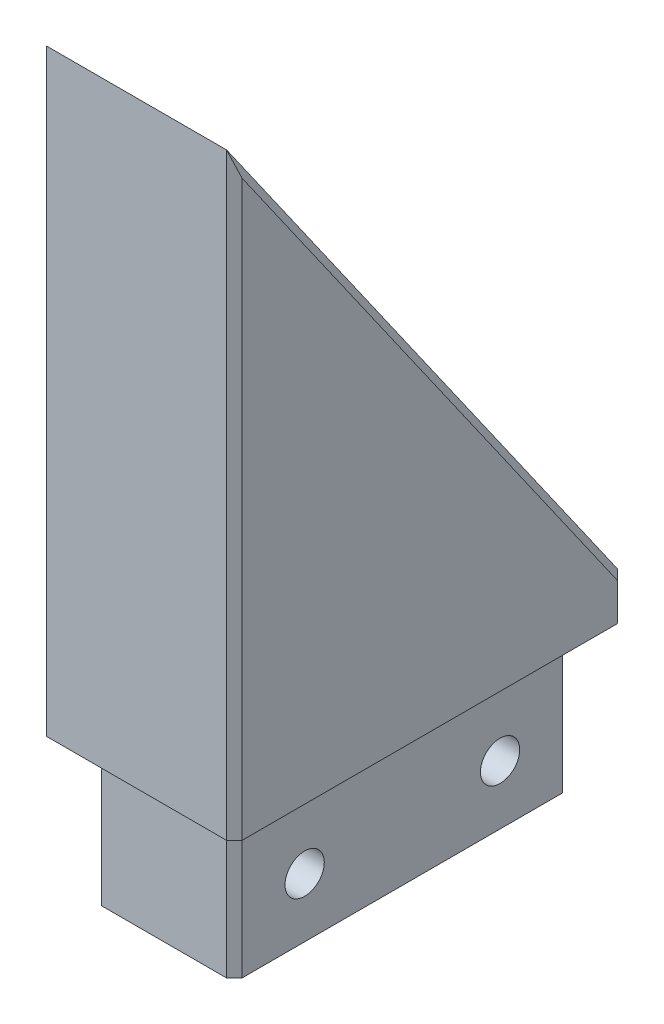
ISO-10303-21;
HEADER;
FILE_DESCRIPTION(('STEP AP214'),'2;1');
FILE_NAME('part.step','',(''),(''),'','','');
FILE_SCHEMA(('AUTOMOTIVE_DESIGN { 1 0 10303 214 1 1 1 1 }'));
ENDSEC;
DATA;
#1=APPLICATION_CONTEXT('core data for automotive mechanical design processes');
#2=APPLICATION_PROTOCOL_DEFINITION('international standard','automotive_design',2000,#1);
#3=PRODUCT_CONTEXT('',#1,'mechanical');
#4=PRODUCT('Part','Part','',(#3));
#5=PRODUCT_RELATED_PRODUCT_CATEGORY('part','',(#4));
#6=PRODUCT_DEFINITION_FORMATION('','',#4);
#7=PRODUCT_DEFINITION_CONTEXT('part definition',#1,'design');
#8=PRODUCT_DEFINITION('design','',#6,#7);
#9=PRODUCT_DEFINITION_SHAPE('','',#8);
#10=(LENGTH_UNIT() NAMED_UNIT(*) SI_UNIT(.MILLI.,.METRE.));
#11=(NAMED_UNIT(*) PLANE_ANGLE_UNIT() SI_UNIT($,.RADIAN.));
#12=(NAMED_UNIT(*) SI_UNIT($,.STERADIAN.) SOLID_ANGLE_UNIT());
#13=UNCERTAINTY_MEASURE_WITH_UNIT(LENGTH_MEASURE(1.E-05),#10,'distance_accuracy_value','');
#14=(GEOMETRIC_REPRESENTATION_CONTEXT(3) GLOBAL_UNCERTAINTY_ASSIGNED_CONTEXT((#13)) GLOBAL_UNIT_ASSIGNED_CONTEXT((#10,
#11,#12)) REPRESENTATION_CONTEXT('',''));
#15=CARTESIAN_POINT('',(0.,0.,0.));
#16=DIRECTION('',(0.,0.,1.));
#17=DIRECTION('',(1.,0.,0.));
#18=AXIS2_PLACEMENT_3D('',#15,#16,#17);
#19=CARTESIAN_POINT('',(12.7,0.,-50.8));
#20=DIRECTION('',(0.,1.,0.));
#21=DIRECTION('',(0.,0.,1.));
#22=AXIS2_PLACEMENT_3D('',#19,#20,#21);
#23=PLANE('',#22);
#24=DIRECTION('',(0.,0.,-1.));
#25=VECTOR('',#24,1.);
#26=CARTESIAN_POINT('',(-12.7,0.,-50.8));
#27=LINE('',#26,#25);
#28=CARTESIAN_POINT('',(-12.7,0.,-1.00000000000001));
#29=VERTEX_POINT('',#28);
#30=CARTESIAN_POINT('',(-12.7,0.,-49.8));
#31=VERTEX_POINT('',#30);
#32=EDGE_CURVE('E192',#29,#31,#27,.T.);
#33=ORIENTED_EDGE('',*,*,#32,.T.);
#34=DIRECTION('',(0.707106781186545,0.,-0.70710678118655));
#35=VECTOR('',#34,1.);
#36=CARTESIAN_POINT('',(-11.7,0.,-50.8));
#37=LINE('',#36,#35);
#38=CARTESIAN_POINT('',(-11.7,0.,-50.8));
#39=VERTEX_POINT('',#38);
#40=EDGE_CURVE('E253',#31,#39,#37,.T.);
#41=ORIENTED_EDGE('',*,*,#40,.T.);
#42=DIRECTION('',(-1.,0.,0.));
#43=VECTOR('',#42,1.);
#44=CARTESIAN_POINT('',(12.7,0.,-50.8));
#45=LINE('',#44,#43);
#46=CARTESIAN_POINT('',(11.7,0.,-50.8));
#47=VERTEX_POINT('',#46);
#48=EDGE_CURVE('E204',#47,#39,#45,.T.);
#49=ORIENTED_EDGE('',*,*,#48,.F.);
#50=DIRECTION('',(-0.707106781186545,0.,-0.70710678118655));
#51=VECTOR('',#50,1.);
#52=CARTESIAN_POINT('',(12.7,0.,-49.8));
#53=LINE('',#52,#51);
#54=CARTESIAN_POINT('',(12.7,0.,-49.8));
#55=VERTEX_POINT('',#54);
#56=EDGE_CURVE('E249',#47,#55,#53,.F.);
#57=ORIENTED_EDGE('',*,*,#56,.T.);
#58=DIRECTION('',(0.,0.,-1.));
#59=VECTOR('',#58,1.);
#60=CARTESIAN_POINT('',(12.7,0.,-50.8));
#61=LINE('',#60,#59);
#62=CARTESIAN_POINT('',(12.7,0.,-1.));
#63=VERTEX_POINT('',#62);
#64=EDGE_CURVE('E188',#63,#55,#61,.T.);
#65=ORIENTED_EDGE('',*,*,#64,.F.);
#66=DIRECTION('',(0.707106781186548,0.,-0.707106781186548));
#67=VECTOR('',#66,1.);
#68=CARTESIAN_POINT('',(12.7,0.,-1.));
#69=LINE('',#68,#67);
#70=CARTESIAN_POINT('',(11.7,0.,0.));
#71=VERTEX_POINT('',#70);
#72=EDGE_CURVE('E247',#63,#71,#69,.F.);
#73=ORIENTED_EDGE('',*,*,#72,.T.);
#74=DIRECTION('',(-1.,0.,0.));
#75=VECTOR('',#74,1.);
#76=CARTESIAN_POINT('',(12.7,0.,0.));
#77=LINE('',#76,#75);
#78=CARTESIAN_POINT('',(-11.7,0.,0.));
#79=VERTEX_POINT('',#78);
#80=EDGE_CURVE('E191',#71,#79,#77,.T.);
#81=ORIENTED_EDGE('',*,*,#80,.T.);
#82=DIRECTION('',(-0.707106781186548,0.,-0.707106781186548));
#83=VECTOR('',#82,1.);
#84=CARTESIAN_POINT('',(-11.7,0.,0.));
#85=LINE('',#84,#83);
#86=EDGE_CURVE('E251',#79,#29,#85,.T.);
#87=ORIENTED_EDGE('',*,*,#86,.T.);
#88=EDGE_LOOP('',(#33,#41,#49,#57,#65,#73,#81,#87));
#89=FACE_BOUND('',#88,.T.);
#90=DIRECTION('',(0.,0.,1.));
#91=VECTOR('',#90,1.);
#92=CARTESIAN_POINT('',(9.14400000000002,0.,-3.556));
#93=LINE('',#92,#91);
#94=CARTESIAN_POINT('',(9.14400000000002,0.,-46.244));
#95=VERTEX_POINT('',#94);
#96=CARTESIAN_POINT('',(9.14400000000002,0.,-4.556));
#97=VERTEX_POINT('',#96);
#98=EDGE_CURVE('E184',#95,#97,#93,.T.);
#99=ORIENTED_EDGE('',*,*,#98,.F.);
#100=DIRECTION('',(0.70710678118654,0.,0.707106781186555));
#101=VECTOR('',#100,1.);
#102=CARTESIAN_POINT('',(8.64399999999995,0.,-46.744));
#103=LINE('',#102,#101);
#104=CARTESIAN_POINT('',(8.144,0.,-47.244));
#105=VERTEX_POINT('',#104);
#106=EDGE_CURVE('E11',#95,#105,#103,.F.);
#107=ORIENTED_EDGE('',*,*,#106,.T.);
#108=DIRECTION('',(1.,0.,0.));
#109=VECTOR('',#108,1.);
#110=CARTESIAN_POINT('',(9.14400000000002,0.,-47.244));
#111=LINE('',#110,#109);
#112=CARTESIAN_POINT('',(-8.14399999999996,0.,-47.244));
#113=VERTEX_POINT('',#112);
#114=EDGE_CURVE('E178',#113,#105,#111,.T.);
#115=ORIENTED_EDGE('',*,*,#114,.F.);
#116=DIRECTION('',(0.707106781186546,0.,-0.707106781186549));
#117=VECTOR('',#116,1.);
#118=CARTESIAN_POINT('',(4.05599999999996,0.,-59.444));
#119=LINE('',#118,#117);
#120=CARTESIAN_POINT('',(-9.14399999999999,0.,-46.244));
#121=VERTEX_POINT('',#120);
#122=EDGE_CURVE('E45',#113,#121,#119,.F.);
#123=ORIENTED_EDGE('',*,*,#122,.T.);
#124=DIRECTION('',(0.,0.,-1.));
#125=VECTOR('',#124,1.);
#126=CARTESIAN_POINT('',(-9.14400000000003,0.,-3.556));
#127=LINE('',#126,#125);
#128=CARTESIAN_POINT('',(-9.14400000000003,0.,-4.556));
#129=VERTEX_POINT('',#128);
#130=EDGE_CURVE('E169',#129,#121,#127,.T.);
#131=ORIENTED_EDGE('',*,*,#130,.F.);
#132=DIRECTION('',(-0.707106781186549,0.,-0.707106781186546));
#133=VECTOR('',#132,1.);
#134=CARTESIAN_POINT('',(-21.344,0.,-16.7559999999999));
#135=LINE('',#134,#133);
#136=CARTESIAN_POINT('',(-8.14400000000002,0.,-3.556));
#137=VERTEX_POINT('',#136);
#138=EDGE_CURVE('E152',#129,#137,#135,.F.);
#139=ORIENTED_EDGE('',*,*,#138,.T.);
#140=DIRECTION('',(-1.,0.,0.));
#141=VECTOR('',#140,1.);
#142=CARTESIAN_POINT('',(9.14400000000002,0.,-3.556));
#143=LINE('',#142,#141);
#144=CARTESIAN_POINT('',(8.14400000000002,0.,-3.556));
#145=VERTEX_POINT('',#144);
#146=EDGE_CURVE('E179',#145,#137,#143,.T.);
#147=ORIENTED_EDGE('',*,*,#146,.F.);
#148=DIRECTION('',(-0.707106781186548,0.,0.707106781186547));
#149=VECTOR('',#148,1.);
#150=CARTESIAN_POINT('',(34.044,0.,-29.456));
#151=LINE('',#150,#149);
#152=EDGE_CURVE('E162',#145,#97,#151,.F.);
#153=ORIENTED_EDGE('',*,*,#152,.T.);
#154=EDGE_LOOP('',(#99,#107,#115,#123,#131,#139,#147,#153));
#155=FACE_BOUND('',#154,.T.);
#156=ADVANCED_FACE('F35',(#89,#155),#23,.F.);
#157=CARTESIAN_POINT('',(12.7,5.17408125750135,-50.8));
#158=DIRECTION('',(0.,0.,1.));
#159=DIRECTION('',(0.,-1.,0.));
#160=AXIS2_PLACEMENT_3D('',#157,#158,#159);
#161=PLANE('',#160);
#162=ORIENTED_EDGE('',*,*,#48,.T.);
#163=DIRECTION('',(0.,1.,0.));
#164=VECTOR('',#163,1.);
#165=CARTESIAN_POINT('',(-11.7,5.17408125750135,-50.8));
#166=LINE('',#165,#164);
#167=CARTESIAN_POINT('',(-11.7,5.17408125750135,-50.8));
#168=VERTEX_POINT('',#167);
#169=EDGE_CURVE('E238',#39,#168,#166,.T.);
#170=ORIENTED_EDGE('',*,*,#169,.T.);
#171=DIRECTION('',(-1.,0.,0.));
#172=VECTOR('',#171,1.);
#173=CARTESIAN_POINT('',(12.7,5.17408125750135,-50.8));
#174=LINE('',#173,#172);
#175=CARTESIAN_POINT('',(11.7,5.17408125750135,-50.8));
#176=VERTEX_POINT('',#175);
#177=EDGE_CURVE('E201',#176,#168,#174,.T.);
#178=ORIENTED_EDGE('',*,*,#177,.F.);
#179=DIRECTION('',(0.,-1.,0.));
#180=VECTOR('',#179,1.);
#181=CARTESIAN_POINT('',(11.7,5.17408125750135,-50.8));
#182=LINE('',#181,#180);
#183=EDGE_CURVE('E236',#176,#47,#182,.T.);
#184=ORIENTED_EDGE('',*,*,#183,.T.);
#185=EDGE_LOOP('',(#162,#170,#178,#184));
#186=FACE_BOUND('',#185,.T.);
#187=ADVANCED_FACE('F291',(#186),#161,.F.);
#188=CARTESIAN_POINT('',(12.7,77.724,0.));
#189=DIRECTION('',(0.,-0.57357643635105,0.819152044288989));
#190=DIRECTION('',(0.,-0.819152044288989,-0.57357643635105));
#191=AXIS2_PLACEMENT_3D('',#188,#189,#190);
#192=PLANE('',#191);
#193=ORIENTED_EDGE('',*,*,#177,.T.);
#194=DIRECTION('',(0.,0.819152044288989,0.57357643635105));
#195=VECTOR('',#194,1.);
#196=CARTESIAN_POINT('',(-11.7,77.724,0.));
#197=LINE('',#196,#195);
#198=CARTESIAN_POINT('',(-11.7,77.724,0.));
#199=VERTEX_POINT('',#198);
#200=EDGE_CURVE('E257',#168,#199,#197,.T.);
#201=ORIENTED_EDGE('',*,*,#200,.T.);
#202=DIRECTION('',(-1.,0.,0.));
#203=VECTOR('',#202,1.);
#204=CARTESIAN_POINT('',(12.7,77.724,0.));
#205=LINE('',#204,#203);
#206=CARTESIAN_POINT('',(11.7,77.724,0.));
#207=VERTEX_POINT('',#206);
#208=EDGE_CURVE('E198',#207,#199,#205,.T.);
#209=ORIENTED_EDGE('',*,*,#208,.F.);
#210=DIRECTION('',(0.,-0.819152044288989,-0.57357643635105));
#211=VECTOR('',#210,1.);
#212=CARTESIAN_POINT('',(11.7,77.724,0.));
#213=LINE('',#212,#211);
#214=EDGE_CURVE('E255',#207,#176,#213,.T.);
#215=ORIENTED_EDGE('',*,*,#214,.T.);
#216=EDGE_LOOP('',(#193,#201,#209,#215));
#217=FACE_BOUND('',#216,.T.);
#218=ADVANCED_FACE('F294',(#217),#192,.F.);
#219=CARTESIAN_POINT('',(12.7,0.,0.));
#220=DIRECTION('',(0.,0.,-1.));
#221=DIRECTION('',(-1.,0.,0.));
#222=AXIS2_PLACEMENT_3D('',#219,#220,#221);
#223=PLANE('',#222);
#224=ORIENTED_EDGE('',*,*,#208,.T.);
#225=DIRECTION('',(0.,-1.,0.));
#226=VECTOR('',#225,1.);
#227=CARTESIAN_POINT('',(-11.7,0.,0.));
#228=LINE('',#227,#226);
#229=EDGE_CURVE('E261',#199,#79,#228,.T.);
#230=ORIENTED_EDGE('',*,*,#229,.T.);
#231=ORIENTED_EDGE('',*,*,#80,.F.);
#232=DIRECTION('',(0.,1.,0.));
#233=VECTOR('',#232,1.);
#234=CARTESIAN_POINT('',(11.7,0.,0.));
#235=LINE('',#234,#233);
#236=EDGE_CURVE('E259',#71,#207,#235,.T.);
#237=ORIENTED_EDGE('',*,*,#236,.T.);
#238=EDGE_LOOP('',(#224,#230,#231,#237));
#239=FACE_BOUND('',#238,.T.);
#240=ADVANCED_FACE('F299',(#239),#223,.F.);
#241=CARTESIAN_POINT('',(12.7,0.,0.));
#242=DIRECTION('',(-1.,0.,0.));
#243=DIRECTION('',(0.,0.,1.));
#244=AXIS2_PLACEMENT_3D('',#241,#242,#243);
#245=PLANE('',#244);
#246=ORIENTED_EDGE('',*,*,#64,.T.);
#247=DIRECTION('',(0.,1.,0.));
#248=VECTOR('',#247,1.);
#249=CARTESIAN_POINT('',(12.7,0.,-49.8));
#250=LINE('',#249,#248);
#251=CARTESIAN_POINT('',(12.7,4.85878246862239,-49.8));
#252=VERTEX_POINT('',#251);
#253=EDGE_CURVE('E163',#55,#252,#250,.T.);
#254=ORIENTED_EDGE('',*,*,#253,.T.);
#255=DIRECTION('',(0.,0.819152044288989,0.57357643635105));
#256=VECTOR('',#255,1.);
#257=CARTESIAN_POINT('',(12.7,24.9968367537272,-35.6991825846931));
#258=LINE('',#257,#256);
#259=CARTESIAN_POINT('',(12.7,74.5524051976368,-1.));
#260=VERTEX_POINT('',#259);
#261=EDGE_CURVE('E60',#252,#260,#258,.T.);
#262=ORIENTED_EDGE('',*,*,#261,.T.);
#263=DIRECTION('',(0.,-1.,0.));
#264=VECTOR('',#263,1.);
#265=CARTESIAN_POINT('',(12.7,0.,-1.));
#266=LINE('',#265,#264);
#267=EDGE_CURVE('E263',#260,#63,#266,.T.);
#268=ORIENTED_EDGE('',*,*,#267,.T.);
#269=EDGE_LOOP('',(#246,#254,#262,#268));
#270=FACE_BOUND('',#269,.T.);
#271=ADVANCED_FACE('F283',(#270),#245,.F.);
#272=CARTESIAN_POINT('',(-12.7,0.,0.));
#273=DIRECTION('',(-1.,0.,0.));
#274=DIRECTION('',(0.,0.,1.));
#275=AXIS2_PLACEMENT_3D('',#272,#273,#274);
#276=PLANE('',#275);
#277=DIRECTION('',(0.,-0.819152044288989,-0.57357643635105));
#278=VECTOR('',#277,1.);
#279=CARTESIAN_POINT('',(-12.7,4.60050482115029,-49.980847955711));
#280=LINE('',#279,#278);
#281=CARTESIAN_POINT('',(-12.7,74.5524051976368,-1.00000000000001));
#282=VERTEX_POINT('',#281);
#283=CARTESIAN_POINT('',(-12.7,4.85878246862237,-49.8));
#284=VERTEX_POINT('',#283);
#285=EDGE_CURVE('E243',#282,#284,#280,.T.);
#286=ORIENTED_EDGE('',*,*,#285,.T.);
#287=DIRECTION('',(0.,-1.,0.));
#288=VECTOR('',#287,1.);
#289=CARTESIAN_POINT('',(-12.7,0.,-49.8));
#290=LINE('',#289,#288);
#291=EDGE_CURVE('E245',#284,#31,#290,.T.);
#292=ORIENTED_EDGE('',*,*,#291,.T.);
#293=ORIENTED_EDGE('',*,*,#32,.F.);
#294=DIRECTION('',(0.,1.,0.));
#295=VECTOR('',#294,1.);
#296=CARTESIAN_POINT('',(-12.7,77.724,-1.00000000000001));
#297=LINE('',#296,#295);
#298=EDGE_CURVE('E241',#29,#282,#297,.T.);
#299=ORIENTED_EDGE('',*,*,#298,.T.);
#300=EDGE_LOOP('',(#286,#292,#293,#299));
#301=FACE_BOUND('',#300,.T.);
#302=ADVANCED_FACE('F311',(#301),#276,.T.);
#303=CARTESIAN_POINT('',(9.14400000000002,-19.05,-3.556));
#304=DIRECTION('',(-1.,0.,0.));
#305=DIRECTION('',(0.,0.,1.));
#306=AXIS2_PLACEMENT_3D('',#303,#304,#305);
#307=PLANE('',#306);
#308=CARTESIAN_POINT('',(9.14400000000002,-11.375365521493,-38.1));
#309=DIRECTION('',(1.,0.,0.));
#310=DIRECTION('',(0.,0.,-1.));
#311=AXIS2_PLACEMENT_3D('',#308,#309,#310);
#312=CIRCLE('',#311,2.5527);
#313=CARTESIAN_POINT('',(9.14400000000002,-11.375365521493,-40.6527));
#314=VERTEX_POINT('',#313);
#315=EDGE_CURVE('E211',#314,#314,#312,.T.);
#316=ORIENTED_EDGE('',*,*,#315,.F.);
#317=EDGE_LOOP('',(#316));
#318=FACE_BOUND('',#317,.T.);
#319=CARTESIAN_POINT('',(9.14400000000002,-11.375365521493,-12.7));
#320=DIRECTION('',(1.,0.,0.));
#321=DIRECTION('',(0.,0.,-1.));
#322=AXIS2_PLACEMENT_3D('',#319,#320,#321);
#323=CIRCLE('',#322,2.5527);
#324=CARTESIAN_POINT('',(9.14400000000002,-11.375365521493,-15.2527));
#325=VERTEX_POINT('',#324);
#326=EDGE_CURVE('E273',#325,#325,#323,.T.);
#327=ORIENTED_EDGE('',*,*,#326,.F.);
#328=EDGE_LOOP('',(#327));
#329=FACE_BOUND('',#328,.T.);
#330=ORIENTED_EDGE('',*,*,#98,.T.);
#331=DIRECTION('',(0.,-1.,0.));
#332=VECTOR('',#331,1.);
#333=CARTESIAN_POINT('',(9.14400000000002,-19.05,-4.556));
#334=LINE('',#333,#332);
#335=CARTESIAN_POINT('',(9.14400000000002,-19.05,-4.556));
#336=VERTEX_POINT('',#335);
#337=EDGE_CURVE('E229',#97,#336,#334,.T.);
#338=ORIENTED_EDGE('',*,*,#337,.T.);
#339=DIRECTION('',(0.,0.,1.));
#340=VECTOR('',#339,1.);
#341=CARTESIAN_POINT('',(9.14400000000002,-19.05,-3.556));
#342=LINE('',#341,#340);
#343=CARTESIAN_POINT('',(9.14400000000002,-19.05,-46.244));
#344=VERTEX_POINT('',#343);
#345=EDGE_CURVE('E182',#344,#336,#342,.T.);
#346=ORIENTED_EDGE('',*,*,#345,.F.);
#347=DIRECTION('',(0.,1.,0.));
#348=VECTOR('',#347,1.);
#349=CARTESIAN_POINT('',(9.14400000000002,-19.05,-46.244));
#350=LINE('',#349,#348);
#351=EDGE_CURVE('E226',#344,#95,#350,.T.);
#352=ORIENTED_EDGE('',*,*,#351,.T.);
#353=EDGE_LOOP('',(#330,#338,#346,#352));
#354=FACE_BOUND('',#353,.T.);
#355=ADVANCED_FACE('F376',(#318,#329,#354),#307,.F.);
#356=CARTESIAN_POINT('',(9.14400000000002,-19.05,-3.556));
#357=DIRECTION('',(0.,0.,-1.));
#358=DIRECTION('',(-1.,0.,0.));
#359=AXIS2_PLACEMENT_3D('',#356,#357,#358);
#360=PLANE('',#359);
#361=ORIENTED_EDGE('',*,*,#146,.T.);
#362=DIRECTION('',(0.,-1.,0.));
#363=VECTOR('',#362,1.);
#364=CARTESIAN_POINT('',(-8.14400000000002,-19.05,-3.556));
#365=LINE('',#364,#363);
#366=CARTESIAN_POINT('',(-8.14400000000002,-19.05,-3.556));
#367=VERTEX_POINT('',#366);
#368=EDGE_CURVE('E157',#137,#367,#365,.T.);
#369=ORIENTED_EDGE('',*,*,#368,.T.);
#370=DIRECTION('',(-1.,0.,0.));
#371=VECTOR('',#370,1.);
#372=CARTESIAN_POINT('',(9.14400000000002,-19.05,-3.556));
#373=LINE('',#372,#371);
#374=CARTESIAN_POINT('',(8.14400000000002,-19.05,-3.556));
#375=VERTEX_POINT('',#374);
#376=EDGE_CURVE('E378',#375,#367,#373,.T.);
#377=ORIENTED_EDGE('',*,*,#376,.F.);
#378=DIRECTION('',(0.,1.,0.));
#379=VECTOR('',#378,1.);
#380=CARTESIAN_POINT('',(8.14400000000002,-19.05,-3.556));
#381=LINE('',#380,#379);
#382=EDGE_CURVE('E173',#375,#145,#381,.T.);
#383=ORIENTED_EDGE('',*,*,#382,.T.);
#384=EDGE_LOOP('',(#361,#369,#377,#383));
#385=FACE_BOUND('',#384,.T.);
#386=ADVANCED_FACE('F388',(#385),#360,.F.);
#387=CARTESIAN_POINT('',(-9.14400000000003,-19.05,-3.556));
#388=DIRECTION('',(1.,0.,0.));
#389=DIRECTION('',(0.,0.,-1.));
#390=AXIS2_PLACEMENT_3D('',#387,#388,#389);
#391=PLANE('',#390);
#392=CARTESIAN_POINT('',(-9.144,-11.375365521493,-38.1));
#393=DIRECTION('',(1.,0.,0.));
#394=DIRECTION('',(0.,0.,-1.));
#395=AXIS2_PLACEMENT_3D('',#392,#393,#394);
#396=CIRCLE('',#395,2.5527);
#397=CARTESIAN_POINT('',(-9.144,-11.375365521493,-40.6527));
#398=VERTEX_POINT('',#397);
#399=EDGE_CURVE('E210',#398,#398,#396,.T.);
#400=ORIENTED_EDGE('',*,*,#399,.T.);
#401=EDGE_LOOP('',(#400));
#402=FACE_BOUND('',#401,.T.);
#403=CARTESIAN_POINT('',(-9.14400000000002,-11.375365521493,-12.7));
#404=DIRECTION('',(1.,0.,0.));
#405=DIRECTION('',(0.,0.,-1.));
#406=AXIS2_PLACEMENT_3D('',#403,#404,#405);
#407=CIRCLE('',#406,2.5527);
#408=CARTESIAN_POINT('',(-9.14400000000002,-11.375365521493,-15.2527));
#409=VERTEX_POINT('',#408);
#410=EDGE_CURVE('E207',#409,#409,#407,.T.);
#411=ORIENTED_EDGE('',*,*,#410,.T.);
#412=EDGE_LOOP('',(#411));
#413=FACE_BOUND('',#412,.T.);
#414=DIRECTION('',(0.,0.,-1.));
#415=VECTOR('',#414,1.);
#416=CARTESIAN_POINT('',(-9.14400000000003,-19.05,-3.556));
#417=LINE('',#416,#415);
#418=CARTESIAN_POINT('',(-9.14400000000003,-19.05,-4.556));
#419=VERTEX_POINT('',#418);
#420=CARTESIAN_POINT('',(-9.14399999999999,-19.05,-46.244));
#421=VERTEX_POINT('',#420);
#422=EDGE_CURVE('E172',#419,#421,#417,.T.);
#423=ORIENTED_EDGE('',*,*,#422,.F.);
#424=DIRECTION('',(0.,1.,0.));
#425=VECTOR('',#424,1.);
#426=CARTESIAN_POINT('',(-9.14400000000003,-19.05,-4.556));
#427=LINE('',#426,#425);
#428=EDGE_CURVE('E156',#419,#129,#427,.T.);
#429=ORIENTED_EDGE('',*,*,#428,.T.);
#430=ORIENTED_EDGE('',*,*,#130,.T.);
#431=DIRECTION('',(0.,-1.,0.));
#432=VECTOR('',#431,1.);
#433=CARTESIAN_POINT('',(-9.14399999999999,-19.05,-46.244));
#434=LINE('',#433,#432);
#435=EDGE_CURVE('E174',#121,#421,#434,.T.);
#436=ORIENTED_EDGE('',*,*,#435,.T.);
#437=EDGE_LOOP('',(#423,#429,#430,#436));
#438=FACE_BOUND('',#437,.T.);
#439=ADVANCED_FACE('F168',(#402,#413,#438),#391,.F.);
#440=CARTESIAN_POINT('',(9.14400000000002,-19.05,-47.244));
#441=DIRECTION('',(0.,0.,1.));
#442=DIRECTION('',(1.,0.,0.));
#443=AXIS2_PLACEMENT_3D('',#440,#441,#442);
#444=PLANE('',#443);
#445=DIRECTION('',(1.,0.,0.));
#446=VECTOR('',#445,1.);
#447=CARTESIAN_POINT('',(9.14400000000002,-19.05,-47.244));
#448=LINE('',#447,#446);
#449=CARTESIAN_POINT('',(-8.14399999999996,-19.05,-47.244));
#450=VERTEX_POINT('',#449);
#451=CARTESIAN_POINT('',(8.144,-19.05,-47.244));
#452=VERTEX_POINT('',#451);
#453=EDGE_CURVE('E195',#450,#452,#448,.T.);
#454=ORIENTED_EDGE('',*,*,#453,.F.);
#455=DIRECTION('',(0.,1.,0.));
#456=VECTOR('',#455,1.);
#457=CARTESIAN_POINT('',(-8.14399999999996,-19.05,-47.244));
#458=LINE('',#457,#456);
#459=EDGE_CURVE('E233',#450,#113,#458,.T.);
#460=ORIENTED_EDGE('',*,*,#459,.T.);
#461=ORIENTED_EDGE('',*,*,#114,.T.);
#462=DIRECTION('',(0.,-1.,0.));
#463=VECTOR('',#462,1.);
#464=CARTESIAN_POINT('',(8.144,-19.05,-47.244));
#465=LINE('',#464,#463);
#466=EDGE_CURVE('E231',#105,#452,#465,.T.);
#467=ORIENTED_EDGE('',*,*,#466,.T.);
#468=EDGE_LOOP('',(#454,#460,#461,#467));
#469=FACE_BOUND('',#468,.T.);
#470=ADVANCED_FACE('F395',(#469),#444,.F.);
#471=CARTESIAN_POINT('',(0.,-19.05,0.));
#472=DIRECTION('',(0.,1.,0.));
#473=DIRECTION('',(0.,0.,1.));
#474=AXIS2_PLACEMENT_3D('',#471,#472,#473);
#475=PLANE('',#474);
#476=ORIENTED_EDGE('',*,*,#376,.T.);
#477=DIRECTION('',(0.707106781186549,0.,0.707106781186546));
#478=VECTOR('',#477,1.);
#479=CARTESIAN_POINT('',(-9.14400000000003,-19.05,-4.556));
#480=LINE('',#479,#478);
#481=EDGE_CURVE('E224',#367,#419,#480,.F.);
#482=ORIENTED_EDGE('',*,*,#481,.T.);
#483=ORIENTED_EDGE('',*,*,#422,.T.);
#484=DIRECTION('',(-0.707106781186546,0.,0.707106781186549));
#485=VECTOR('',#484,1.);
#486=CARTESIAN_POINT('',(-8.14399999999996,-19.05,-47.244));
#487=LINE('',#486,#485);
#488=EDGE_CURVE('E220',#421,#450,#487,.F.);
#489=ORIENTED_EDGE('',*,*,#488,.T.);
#490=ORIENTED_EDGE('',*,*,#453,.T.);
#491=DIRECTION('',(-0.70710678118654,0.,-0.707106781186555));
#492=VECTOR('',#491,1.);
#493=CARTESIAN_POINT('',(9.14400000000002,-19.05,-46.244));
#494=LINE('',#493,#492);
#495=EDGE_CURVE('E218',#452,#344,#494,.F.);
#496=ORIENTED_EDGE('',*,*,#495,.T.);
#497=ORIENTED_EDGE('',*,*,#345,.T.);
#498=DIRECTION('',(0.707106781186548,0.,-0.707106781186547));
#499=VECTOR('',#498,1.);
#500=CARTESIAN_POINT('',(8.14400000000002,-19.05,-3.556));
#501=LINE('',#500,#499);
#502=EDGE_CURVE('E222',#336,#375,#501,.F.);
#503=ORIENTED_EDGE('',*,*,#502,.T.);
#504=EDGE_LOOP('',(#476,#482,#483,#489,#490,#496,#497,#503));
#505=FACE_BOUND('',#504,.T.);
#506=ADVANCED_FACE('F371',(#505),#475,.F.);
#507=CARTESIAN_POINT('',(-12.7,-11.375365521493,-12.7));
#508=DIRECTION('',(1.,0.,0.));
#509=DIRECTION('',(0.,0.,-1.));
#510=AXIS2_PLACEMENT_3D('',#507,#508,#509);
#511=CYLINDRICAL_SURFACE('',#510,2.5527);
#512=ORIENTED_EDGE('',*,*,#326,.T.);
#513=EDGE_LOOP('',(#512));
#514=FACE_BOUND('',#513,.T.);
#515=ORIENTED_EDGE('',*,*,#410,.F.);
#516=EDGE_LOOP('',(#515));
#517=FACE_BOUND('',#516,.T.);
#518=ADVANCED_FACE('F456',(#514,#517),#511,.F.);
#519=CARTESIAN_POINT('',(-12.7,-11.375365521493,-38.1));
#520=DIRECTION('',(1.,0.,0.));
#521=DIRECTION('',(0.,0.,-1.));
#522=AXIS2_PLACEMENT_3D('',#519,#520,#521);
#523=CYLINDRICAL_SURFACE('',#522,2.5527);
#524=ORIENTED_EDGE('',*,*,#315,.T.);
#525=EDGE_LOOP('',(#524));
#526=FACE_BOUND('',#525,.T.);
#527=ORIENTED_EDGE('',*,*,#399,.F.);
#528=EDGE_LOOP('',(#527));
#529=FACE_BOUND('',#528,.T.);
#530=ADVANCED_FACE('F340',(#526,#529),#523,.F.);
#531=CARTESIAN_POINT('',(-9.14400000000003,-19.05,-4.556));
#532=DIRECTION('',(0.707106781186546,0.,-0.707106781186549));
#533=DIRECTION('',(0.,1.,0.));
#534=AXIS2_PLACEMENT_3D('',#531,#532,#533);
#535=PLANE('',#534);
#536=ORIENTED_EDGE('',*,*,#481,.F.);
#537=ORIENTED_EDGE('',*,*,#368,.F.);
#538=ORIENTED_EDGE('',*,*,#138,.F.);
#539=ORIENTED_EDGE('',*,*,#428,.F.);
#540=EDGE_LOOP('',(#536,#537,#538,#539));
#541=FACE_BOUND('',#540,.T.);
#542=ADVANCED_FACE('F155',(#541),#535,.F.);
#543=CARTESIAN_POINT('',(8.14400000000002,-19.05,-3.556));
#544=DIRECTION('',(-0.707106781186547,0.,-0.707106781186548));
#545=DIRECTION('',(0.,1.,0.));
#546=AXIS2_PLACEMENT_3D('',#543,#544,#545);
#547=PLANE('',#546);
#548=ORIENTED_EDGE('',*,*,#502,.F.);
#549=ORIENTED_EDGE('',*,*,#337,.F.);
#550=ORIENTED_EDGE('',*,*,#152,.F.);
#551=ORIENTED_EDGE('',*,*,#382,.F.);
#552=EDGE_LOOP('',(#548,#549,#550,#551));
#553=FACE_BOUND('',#552,.T.);
#554=ADVANCED_FACE('F339',(#553),#547,.F.);
#555=CARTESIAN_POINT('',(-8.14399999999996,-19.05,-47.244));
#556=DIRECTION('',(0.707106781186549,0.,0.707106781186546));
#557=DIRECTION('',(0.,1.,0.));
#558=AXIS2_PLACEMENT_3D('',#555,#556,#557);
#559=PLANE('',#558);
#560=ORIENTED_EDGE('',*,*,#488,.F.);
#561=ORIENTED_EDGE('',*,*,#435,.F.);
#562=ORIENTED_EDGE('',*,*,#122,.F.);
#563=ORIENTED_EDGE('',*,*,#459,.F.);
#564=EDGE_LOOP('',(#560,#561,#562,#563));
#565=FACE_BOUND('',#564,.T.);
#566=ADVANCED_FACE('F346',(#565),#559,.F.);
#567=CARTESIAN_POINT('',(9.14400000000002,-19.05,-46.244));
#568=DIRECTION('',(-0.707106781186555,0.,0.70710678118654));
#569=DIRECTION('',(0.,1.,0.));
#570=AXIS2_PLACEMENT_3D('',#567,#568,#569);
#571=PLANE('',#570);
#572=ORIENTED_EDGE('',*,*,#495,.F.);
#573=ORIENTED_EDGE('',*,*,#466,.F.);
#574=ORIENTED_EDGE('',*,*,#106,.F.);
#575=ORIENTED_EDGE('',*,*,#351,.F.);
#576=EDGE_LOOP('',(#572,#573,#574,#575));
#577=FACE_BOUND('',#576,.T.);
#578=ADVANCED_FACE('F352',(#577),#571,.F.);
#579=CARTESIAN_POINT('',(-11.7,0.,0.));
#580=DIRECTION('',(-0.707106781186547,0.,0.707106781186547));
#581=DIRECTION('',(0.,1.,0.));
#582=AXIS2_PLACEMENT_3D('',#579,#580,#581);
#583=PLANE('',#582);
#584=ORIENTED_EDGE('',*,*,#86,.F.);
#585=ORIENTED_EDGE('',*,*,#229,.F.);
#586=DIRECTION('',(-0.287967918814631,-0.913317554559826,-0.287967918814631));
#587=VECTOR('',#586,1.);
#588=CARTESIAN_POINT('',(-32.1418904225786,12.890606585272,-20.4418904225786));
#589=LINE('',#588,#587);
#590=EDGE_CURVE('E271',#282,#199,#589,.F.);
#591=ORIENTED_EDGE('',*,*,#590,.F.);
#592=ORIENTED_EDGE('',*,*,#298,.F.);
#593=EDGE_LOOP('',(#584,#585,#591,#592));
#594=FACE_BOUND('',#593,.T.);
#595=ADVANCED_FACE('F303',(#594),#583,.T.);
#596=CARTESIAN_POINT('',(-11.7,77.724,0.));
#597=DIRECTION('',(-0.707106781186547,0.405579787672642,-0.579227965339567));
#598=DIRECTION('',(0.,-0.819152044288989,-0.57357643635105));
#599=AXIS2_PLACEMENT_3D('',#596,#597,#598);
#600=PLANE('',#599);
#601=ORIENTED_EDGE('',*,*,#590,.T.);
#602=ORIENTED_EDGE('',*,*,#200,.F.);
#603=DIRECTION('',(-0.690161970814194,-0.217607233528042,0.690161970814199));
#604=VECTOR('',#603,1.);
#605=CARTESIAN_POINT('',(-25.0013819326639,0.980171643715749,-37.498618067336));
#606=LINE('',#605,#604);
#607=EDGE_CURVE('E269',#284,#168,#606,.F.);
#608=ORIENTED_EDGE('',*,*,#607,.F.);
#609=ORIENTED_EDGE('',*,*,#285,.F.);
#610=EDGE_LOOP('',(#601,#602,#608,#609));
#611=FACE_BOUND('',#610,.T.);
#612=ADVANCED_FACE('F307',(#611),#600,.T.);
#613=CARTESIAN_POINT('',(-11.7,5.17408125750135,-50.8));
#614=DIRECTION('',(-0.70710678118655,0.,-0.707106781186545));
#615=DIRECTION('',(0.,-1.,0.));
#616=AXIS2_PLACEMENT_3D('',#613,#614,#615);
#617=PLANE('',#616);
#618=ORIENTED_EDGE('',*,*,#40,.F.);
#619=ORIENTED_EDGE('',*,*,#291,.F.);
#620=ORIENTED_EDGE('',*,*,#607,.T.);
#621=ORIENTED_EDGE('',*,*,#169,.F.);
#622=EDGE_LOOP('',(#618,#619,#620,#621));
#623=FACE_BOUND('',#622,.T.);
#624=ADVANCED_FACE('F315',(#623),#617,.T.);
#625=CARTESIAN_POINT('',(12.7,0.,-1.));
#626=DIRECTION('',(-0.707106781186547,0.,-0.707106781186547));
#627=DIRECTION('',(0.,-1.,0.));
#628=AXIS2_PLACEMENT_3D('',#625,#626,#627);
#629=PLANE('',#628);
#630=ORIENTED_EDGE('',*,*,#72,.F.);
#631=ORIENTED_EDGE('',*,*,#267,.F.);
#632=DIRECTION('',(-0.287967918814632,0.913317554559825,0.287967918814632));
#633=VECTOR('',#632,1.);
#634=CARTESIAN_POINT('',(32.3077414671115,12.3645942744651,-20.6077414671115));
#635=LINE('',#634,#633);
#636=EDGE_CURVE('E40',#207,#260,#635,.F.);
#637=ORIENTED_EDGE('',*,*,#636,.F.);
#638=ORIENTED_EDGE('',*,*,#236,.F.);
#639=EDGE_LOOP('',(#630,#631,#637,#638));
#640=FACE_BOUND('',#639,.T.);
#641=ADVANCED_FACE('F38',(#640),#629,.F.);
#642=CARTESIAN_POINT('',(12.7,24.9968367537272,-35.6991825846931));
#643=DIRECTION('',(-0.707106781186545,-0.405579787672643,0.579227965339569));
#644=DIRECTION('',(0.,0.819152044288989,0.57357643635105));
#645=AXIS2_PLACEMENT_3D('',#642,#643,#644);
#646=PLANE('',#645);
#647=ORIENTED_EDGE('',*,*,#636,.T.);
#648=ORIENTED_EDGE('',*,*,#261,.F.);
#649=DIRECTION('',(-0.690161970814195,0.217607233528034,-0.6901619708142));
#650=VECTOR('',#649,1.);
#651=CARTESIAN_POINT('',(16.3921330315701,3.69465739538832,-46.1078669684299));
#652=LINE('',#651,#650);
#653=EDGE_CURVE('E53',#176,#252,#652,.F.);
#654=ORIENTED_EDGE('',*,*,#653,.F.);
#655=ORIENTED_EDGE('',*,*,#214,.F.);
#656=EDGE_LOOP('',(#647,#648,#654,#655));
#657=FACE_BOUND('',#656,.T.);
#658=ADVANCED_FACE('F278',(#657),#646,.F.);
#659=CARTESIAN_POINT('',(12.7,0.,-49.8));
#660=DIRECTION('',(-0.70710678118655,0.,0.707106781186545));
#661=DIRECTION('',(0.,1.,0.));
#662=AXIS2_PLACEMENT_3D('',#659,#660,#661);
#663=PLANE('',#662);
#664=ORIENTED_EDGE('',*,*,#56,.F.);
#665=ORIENTED_EDGE('',*,*,#183,.F.);
#666=ORIENTED_EDGE('',*,*,#653,.T.);
#667=ORIENTED_EDGE('',*,*,#253,.F.);
#668=EDGE_LOOP('',(#664,#665,#666,#667));
#669=FACE_BOUND('',#668,.T.);
#670=ADVANCED_FACE('F288',(#669),#663,.F.);
#671=CLOSED_SHELL('',(#156,#187,#218,#240,#271,#302,#355,#386,#439,#470,#506,#518,#530,#542,
#554,#566,#578,#595,#612,#624,#641,#658,#670));
#672=MANIFOLD_SOLID_BREP('B2',#671);
#673=ADVANCED_BREP_SHAPE_REPRESENTATION('',(#18,#672),#14);
#674=SHAPE_DEFINITION_REPRESENTATION(#9,#673);
ENDSEC;
END-ISO-10303-21;
